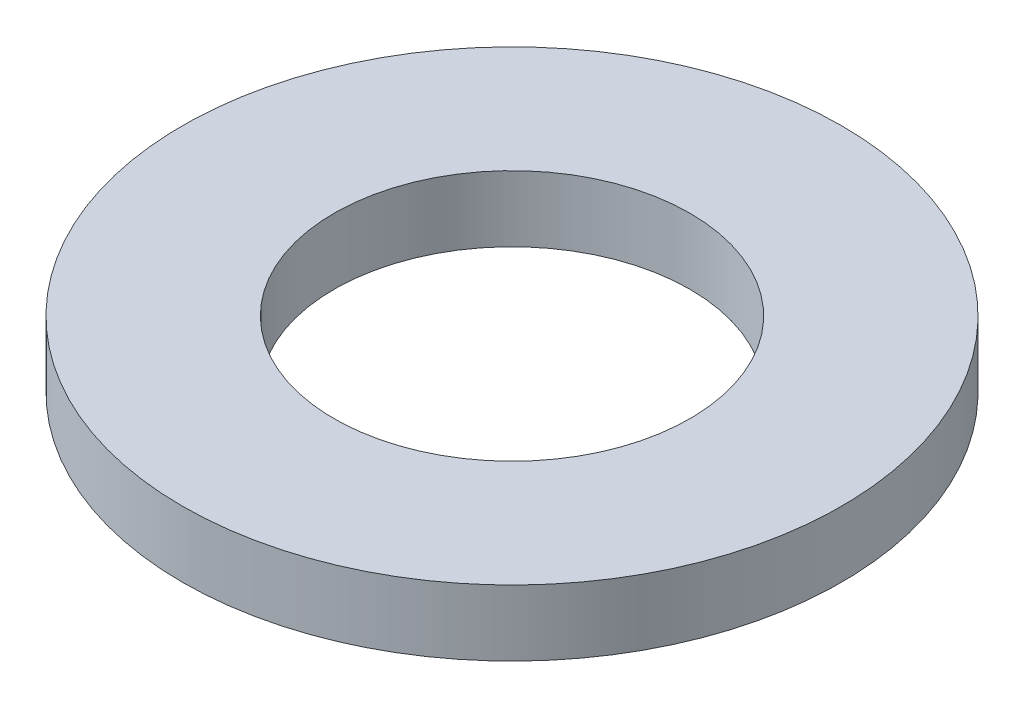
ISO-10303-21;
HEADER;
FILE_DESCRIPTION(('STEP AP214'),'2;1');
FILE_NAME('part.step','',(''),(''),'','','');
FILE_SCHEMA(('AUTOMOTIVE_DESIGN { 1 0 10303 214 1 1 1 1 }'));
ENDSEC;
DATA;
#1=APPLICATION_CONTEXT('core data for automotive mechanical design processes');
#2=APPLICATION_PROTOCOL_DEFINITION('international standard','automotive_design',2000,#1);
#3=PRODUCT_CONTEXT('',#1,'mechanical');
#4=PRODUCT('Part','Part','',(#3));
#5=PRODUCT_RELATED_PRODUCT_CATEGORY('part','',(#4));
#6=PRODUCT_DEFINITION_FORMATION('','',#4);
#7=PRODUCT_DEFINITION_CONTEXT('part definition',#1,'design');
#8=PRODUCT_DEFINITION('design','',#6,#7);
#9=PRODUCT_DEFINITION_SHAPE('','',#8);
#10=(LENGTH_UNIT() NAMED_UNIT(*) SI_UNIT(.MILLI.,.METRE.));
#11=(NAMED_UNIT(*) PLANE_ANGLE_UNIT() SI_UNIT($,.RADIAN.));
#12=(NAMED_UNIT(*) SI_UNIT($,.STERADIAN.) SOLID_ANGLE_UNIT());
#13=UNCERTAINTY_MEASURE_WITH_UNIT(LENGTH_MEASURE(1.E-05),#10,'distance_accuracy_value','');
#14=(GEOMETRIC_REPRESENTATION_CONTEXT(3) GLOBAL_UNCERTAINTY_ASSIGNED_CONTEXT((#13)) GLOBAL_UNIT_ASSIGNED_CONTEXT((#10,
#11,#12)) REPRESENTATION_CONTEXT('',''));
#15=CARTESIAN_POINT('',(0.,0.,0.));
#16=DIRECTION('',(0.,0.,1.));
#17=DIRECTION('',(1.,0.,0.));
#18=AXIS2_PLACEMENT_3D('',#15,#16,#17);
#19=CARTESIAN_POINT('',(0.,-1.,350.));
#20=DIRECTION('',(0.,-1.,0.));
#21=DIRECTION('',(0.,0.,-1.));
#22=AXIS2_PLACEMENT_3D('',#19,#20,#21);
#23=PLANE('',#22);
#24=CARTESIAN_POINT('',(0.,-1.,350.));
#25=DIRECTION('',(0.,-1.,0.));
#26=DIRECTION('',(0.,0.,-1.));
#27=AXIS2_PLACEMENT_3D('',#24,#25,#26);
#28=CIRCLE('',#27,2.7);
#29=CARTESIAN_POINT('',(0.,-1.,347.3));
#30=VERTEX_POINT('',#29);
#31=EDGE_CURVE('E27',#30,#30,#28,.F.);
#32=ORIENTED_EDGE('',*,*,#31,.T.);
#33=EDGE_LOOP('',(#32));
#34=FACE_BOUND('',#33,.T.);
#35=CARTESIAN_POINT('',(0.,-1.,350.));
#36=DIRECTION('',(0.,-1.,0.));
#37=DIRECTION('',(0.,0.,-1.));
#38=AXIS2_PLACEMENT_3D('',#35,#36,#37);
#39=CIRCLE('',#38,4.99999999999999);
#40=CARTESIAN_POINT('',(0.,-1.,345.));
#41=VERTEX_POINT('',#40);
#42=EDGE_CURVE('E18',#41,#41,#39,.F.);
#43=ORIENTED_EDGE('',*,*,#42,.F.);
#44=EDGE_LOOP('',(#43));
#45=FACE_BOUND('',#44,.T.);
#46=ADVANCED_FACE('F15',(#34,#45),#23,.T.);
#47=CARTESIAN_POINT('',(0.,0.,350.));
#48=DIRECTION('',(0.,-1.,0.));
#49=DIRECTION('',(0.,0.,-1.));
#50=AXIS2_PLACEMENT_3D('',#47,#48,#49);
#51=CYLINDRICAL_SURFACE('',#50,4.99999999999999);
#52=CARTESIAN_POINT('',(0.,0.,350.));
#53=DIRECTION('',(0.,-1.,0.));
#54=DIRECTION('',(0.,0.,-1.));
#55=AXIS2_PLACEMENT_3D('',#52,#53,#54);
#56=CIRCLE('',#55,4.99999999999999);
#57=CARTESIAN_POINT('',(0.,0.,345.));
#58=VERTEX_POINT('',#57);
#59=EDGE_CURVE('E22',#58,#58,#56,.T.);
#60=ORIENTED_EDGE('',*,*,#59,.T.);
#61=EDGE_LOOP('',(#60));
#62=FACE_BOUND('',#61,.T.);
#63=ORIENTED_EDGE('',*,*,#42,.T.);
#64=EDGE_LOOP('',(#63));
#65=FACE_BOUND('',#64,.T.);
#66=ADVANCED_FACE('F35',(#62,#65),#51,.T.);
#67=CARTESIAN_POINT('',(0.,0.,350.));
#68=DIRECTION('',(0.,-1.,0.));
#69=DIRECTION('',(0.,0.,-1.));
#70=AXIS2_PLACEMENT_3D('',#67,#68,#69);
#71=CYLINDRICAL_SURFACE('',#70,2.7);
#72=CARTESIAN_POINT('',(0.,0.,350.));
#73=DIRECTION('',(0.,-1.,0.));
#74=DIRECTION('',(0.,0.,-1.));
#75=AXIS2_PLACEMENT_3D('',#72,#73,#74);
#76=CIRCLE('',#75,2.7);
#77=CARTESIAN_POINT('',(0.,0.,347.3));
#78=VERTEX_POINT('',#77);
#79=EDGE_CURVE('E10',#78,#78,#76,.F.);
#80=ORIENTED_EDGE('',*,*,#79,.T.);
#81=EDGE_LOOP('',(#80));
#82=FACE_BOUND('',#81,.T.);
#83=ORIENTED_EDGE('',*,*,#31,.F.);
#84=EDGE_LOOP('',(#83));
#85=FACE_BOUND('',#84,.T.);
#86=ADVANCED_FACE('F42',(#82,#85),#71,.F.);
#87=CARTESIAN_POINT('',(0.,0.,350.));
#88=DIRECTION('',(0.,-1.,0.));
#89=DIRECTION('',(0.,0.,-1.));
#90=AXIS2_PLACEMENT_3D('',#87,#88,#89);
#91=PLANE('',#90);
#92=ORIENTED_EDGE('',*,*,#79,.F.);
#93=EDGE_LOOP('',(#92));
#94=FACE_BOUND('',#93,.T.);
#95=ORIENTED_EDGE('',*,*,#59,.F.);
#96=EDGE_LOOP('',(#95));
#97=FACE_BOUND('',#96,.T.);
#98=ADVANCED_FACE('F44',(#94,#97),#91,.F.);
#99=CLOSED_SHELL('',(#46,#66,#86,#98));
#100=MANIFOLD_SOLID_BREP('B1',#99);
#101=ADVANCED_BREP_SHAPE_REPRESENTATION('',(#18,#100),#14);
#102=SHAPE_DEFINITION_REPRESENTATION(#9,#101);
ENDSEC;
END-ISO-10303-21;
